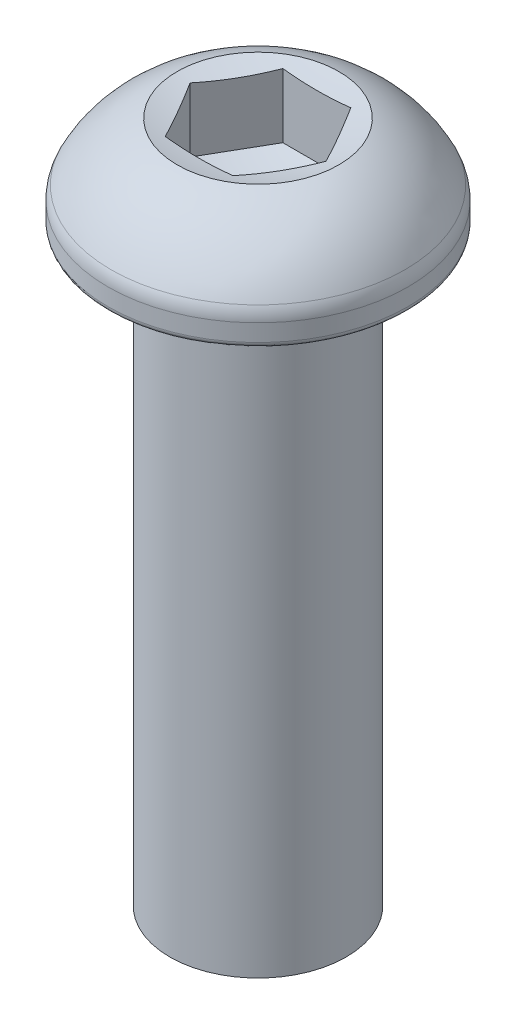
ISO-10303-21;
HEADER;
FILE_DESCRIPTION(('STEP AP214'),'2;1');
FILE_NAME('part.step','',(''),(''),'','','');
FILE_SCHEMA(('AUTOMOTIVE_DESIGN { 1 0 10303 214 1 1 1 1 }'));
ENDSEC;
DATA;
#1=APPLICATION_CONTEXT('core data for automotive mechanical design processes');
#2=APPLICATION_PROTOCOL_DEFINITION('international standard','automotive_design',2000,#1);
#3=PRODUCT_CONTEXT('',#1,'mechanical');
#4=PRODUCT('Part','Part','',(#3));
#5=PRODUCT_RELATED_PRODUCT_CATEGORY('part','',(#4));
#6=PRODUCT_DEFINITION_FORMATION('','',#4);
#7=PRODUCT_DEFINITION_CONTEXT('part definition',#1,'design');
#8=PRODUCT_DEFINITION('design','',#6,#7);
#9=PRODUCT_DEFINITION_SHAPE('','',#8);
#10=(LENGTH_UNIT() NAMED_UNIT(*) SI_UNIT(.MILLI.,.METRE.));
#11=(NAMED_UNIT(*) PLANE_ANGLE_UNIT() SI_UNIT($,.RADIAN.));
#12=(NAMED_UNIT(*) SI_UNIT($,.STERADIAN.) SOLID_ANGLE_UNIT());
#13=UNCERTAINTY_MEASURE_WITH_UNIT(LENGTH_MEASURE(1.E-05),#10,'distance_accuracy_value','');
#14=(GEOMETRIC_REPRESENTATION_CONTEXT(3) GLOBAL_UNCERTAINTY_ASSIGNED_CONTEXT((#13)) GLOBAL_UNIT_ASSIGNED_CONTEXT((#10,
#11,#12)) REPRESENTATION_CONTEXT('',''));
#15=CARTESIAN_POINT('',(0.,0.,0.));
#16=DIRECTION('',(0.,0.,1.));
#17=DIRECTION('',(1.,0.,0.));
#18=AXIS2_PLACEMENT_3D('',#15,#16,#17);
#19=CARTESIAN_POINT('',(0.,-0.573251742610998,0.));
#20=DIRECTION('',(0.,1.,0.));
#21=DIRECTION('',(0.,0.,1.));
#22=AXIS2_PLACEMENT_3D('',#19,#20,#21);
#23=DEGENERATE_TOROIDAL_SURFACE('',#22,1.42238134734289,4.,.T.);
#24=CARTESIAN_POINT('',(0.,1.23062475029976,0.));
#25=DIRECTION('',(0.,-1.,0.));
#26=DIRECTION('',(0.,0.,-1.));
#27=AXIS2_PLACEMENT_3D('',#24,#25,#26);
#28=CIRCLE('',#27,4.9925395508857);
#29=CARTESIAN_POINT('',(0.,1.23062475029976,-4.9925395508857));
#30=VERTEX_POINT('',#29);
#31=EDGE_CURVE('E136',#30,#30,#28,.F.);
#32=ORIENTED_EDGE('',*,*,#31,.T.);
#33=EDGE_LOOP('',(#32));
#34=FACE_BOUND('',#33,.T.);
#35=CARTESIAN_POINT('',(0.,3.2,0.));
#36=DIRECTION('',(0.,1.,0.));
#37=DIRECTION('',(0.,0.,1.));
#38=AXIS2_PLACEMENT_3D('',#35,#36,#37);
#39=CIRCLE('',#38,2.75);
#40=CARTESIAN_POINT('',(0.,3.2,2.75));
#41=VERTEX_POINT('',#40);
#42=EDGE_CURVE('E217',#41,#41,#39,.T.);
#43=ORIENTED_EDGE('',*,*,#42,.F.);
#44=EDGE_LOOP('',(#43));
#45=FACE_BOUND('',#44,.T.);
#46=ADVANCED_FACE('F39',(#34,#45),#23,.T.);
#47=CARTESIAN_POINT('',(0.,55.,0.));
#48=DIRECTION('',(0.,1.,0.));
#49=DIRECTION('',(0.,0.,1.));
#50=AXIS2_PLACEMENT_3D('',#47,#48,#49);
#51=CYLINDRICAL_SURFACE('',#50,5.1);
#52=CARTESIAN_POINT('',(0.,0.779655627072072,0.));
#53=DIRECTION('',(0.,-1.,0.));
#54=DIRECTION('',(0.,0.,-1.));
#55=AXIS2_PLACEMENT_3D('',#52,#53,#54);
#56=CIRCLE('',#55,5.1);
#57=CARTESIAN_POINT('',(0.,0.779655627072072,-5.1));
#58=VERTEX_POINT('',#57);
#59=EDGE_CURVE('E140',#58,#58,#56,.T.);
#60=ORIENTED_EDGE('',*,*,#59,.T.);
#61=EDGE_LOOP('',(#60));
#62=FACE_BOUND('',#61,.T.);
#63=CARTESIAN_POINT('',(0.,0.199999999999999,0.));
#64=DIRECTION('',(0.,1.,0.));
#65=DIRECTION('',(0.,0.,1.));
#66=AXIS2_PLACEMENT_3D('',#63,#64,#65);
#67=CIRCLE('',#66,5.1);
#68=CARTESIAN_POINT('',(0.,0.199999999999999,5.1));
#69=VERTEX_POINT('',#68);
#70=EDGE_CURVE('E128',#69,#69,#67,.T.);
#71=ORIENTED_EDGE('',*,*,#70,.T.);
#72=EDGE_LOOP('',(#71));
#73=FACE_BOUND('',#72,.T.);
#74=ADVANCED_FACE('F153',(#62,#73),#51,.T.);
#75=CARTESIAN_POINT('',(0.,0.,0.));
#76=DIRECTION('',(0.,1.,0.));
#77=DIRECTION('',(0.,0.,1.));
#78=AXIS2_PLACEMENT_3D('',#75,#76,#77);
#79=PLANE('',#78);
#80=CARTESIAN_POINT('',(0.,0.,0.));
#81=DIRECTION('',(0.,1.,0.));
#82=DIRECTION('',(0.,0.,1.));
#83=AXIS2_PLACEMENT_3D('',#80,#81,#82);
#84=CIRCLE('',#83,3.);
#85=CARTESIAN_POINT('',(0.,0.,3.));
#86=VERTEX_POINT('',#85);
#87=EDGE_CURVE('E48',#86,#86,#84,.F.);
#88=ORIENTED_EDGE('',*,*,#87,.F.);
#89=EDGE_LOOP('',(#88));
#90=FACE_BOUND('',#89,.T.);
#91=CARTESIAN_POINT('',(0.,0.,0.));
#92=DIRECTION('',(0.,1.,0.));
#93=DIRECTION('',(0.,0.,1.));
#94=AXIS2_PLACEMENT_3D('',#91,#92,#93);
#95=CIRCLE('',#94,4.9);
#96=CARTESIAN_POINT('',(0.,0.,4.9));
#97=VERTEX_POINT('',#96);
#98=EDGE_CURVE('E132',#97,#97,#95,.F.);
#99=ORIENTED_EDGE('',*,*,#98,.T.);
#100=EDGE_LOOP('',(#99));
#101=FACE_BOUND('',#100,.T.);
#102=ADVANCED_FACE('F149',(#90,#101),#79,.F.);
#103=CARTESIAN_POINT('',(0.,0.199999999999999,0.));
#104=DIRECTION('',(0.,1.,0.));
#105=DIRECTION('',(0.,0.,1.));
#106=AXIS2_PLACEMENT_3D('',#103,#104,#105);
#107=TOROIDAL_SURFACE('',#106,4.9,0.2);
#108=ORIENTED_EDGE('',*,*,#98,.F.);
#109=EDGE_LOOP('',(#108));
#110=FACE_BOUND('',#109,.T.);
#111=ORIENTED_EDGE('',*,*,#70,.F.);
#112=EDGE_LOOP('',(#111));
#113=FACE_BOUND('',#112,.T.);
#114=ADVANCED_FACE('F152',(#110,#113),#107,.T.);
#115=CARTESIAN_POINT('',(0.,0.779655627072072,0.));
#116=DIRECTION('',(0.,-1.,0.));
#117=DIRECTION('',(0.,0.,-1.));
#118=AXIS2_PLACEMENT_3D('',#115,#116,#117);
#119=TOROIDAL_SURFACE('',#118,4.1,1.);
#120=ORIENTED_EDGE('',*,*,#59,.F.);
#121=EDGE_LOOP('',(#120));
#122=FACE_BOUND('',#121,.T.);
#123=ORIENTED_EDGE('',*,*,#31,.F.);
#124=EDGE_LOOP('',(#123));
#125=FACE_BOUND('',#124,.T.);
#126=ADVANCED_FACE('F41',(#122,#125),#119,.T.);
#127=CARTESIAN_POINT('',(0.,-20.,0.));
#128=DIRECTION('',(0.,1.,0.));
#129=DIRECTION('',(0.,0.,1.));
#130=AXIS2_PLACEMENT_3D('',#127,#128,#129);
#131=CYLINDRICAL_SURFACE('',#130,3.);
#132=CARTESIAN_POINT('',(0.,-20.,0.));
#133=DIRECTION('',(0.,-1.,0.));
#134=DIRECTION('',(0.,0.,-1.));
#135=AXIS2_PLACEMENT_3D('',#132,#133,#134);
#136=CIRCLE('',#135,3.);
#137=CARTESIAN_POINT('',(0.,-20.,-3.));
#138=VERTEX_POINT('',#137);
#139=EDGE_CURVE('E124',#138,#138,#136,.T.);
#140=ORIENTED_EDGE('',*,*,#139,.F.);
#141=EDGE_LOOP('',(#140));
#142=FACE_BOUND('',#141,.T.);
#143=ORIENTED_EDGE('',*,*,#87,.T.);
#144=EDGE_LOOP('',(#143));
#145=FACE_BOUND('',#144,.T.);
#146=ADVANCED_FACE('F147',(#142,#145),#131,.T.);
#147=CARTESIAN_POINT('',(0.,-20.,0.));
#148=DIRECTION('',(0.,-1.,0.));
#149=DIRECTION('',(0.,0.,-1.));
#150=AXIS2_PLACEMENT_3D('',#147,#148,#149);
#151=PLANE('',#150);
#152=ORIENTED_EDGE('',*,*,#139,.T.);
#153=EDGE_LOOP('',(#152));
#154=FACE_BOUND('',#153,.T.);
#155=ADVANCED_FACE('F172',(#154),#151,.T.);
#156=CARTESIAN_POINT('',(0.,12.8144422615147,0.));
#157=DIRECTION('',(0.,1.,0.));
#158=DIRECTION('',(1.,0.,0.));
#159=AXIS2_PLACEMENT_3D('',#156,#157,#158);
#160=SPHERICAL_SURFACE('',#159,10.);
#161=ORIENTED_EDGE('',*,*,#42,.T.);
#162=EDGE_LOOP('',(#161));
#163=FACE_BOUND('',#162,.T.);
#164=CARTESIAN_POINT('',(-1.73205080756888,12.8144422615147,1.));
#165=DIRECTION('',(-0.866025403784438,0.,0.5));
#166=DIRECTION('',(0.5,0.,0.866025403784438));
#167=AXIS2_PLACEMENT_3D('',#164,#165,#166);
#168=CIRCLE('',#167,9.79795897113272);
#169=CARTESIAN_POINT('',(-2.3094010767585,3.08476258196376,0.));
#170=VERTEX_POINT('',#169);
#171=CARTESIAN_POINT('',(-1.15470053837925,3.08476258196376,2.));
#172=VERTEX_POINT('',#171);
#173=EDGE_CURVE('E108',#170,#172,#168,.T.);
#174=ORIENTED_EDGE('',*,*,#173,.F.);
#175=CARTESIAN_POINT('',(-1.73205080756888,12.8144422615147,-1.));
#176=DIRECTION('',(-0.866025403784438,0.,-0.5));
#177=DIRECTION('',(-0.5,0.,0.866025403784439));
#178=AXIS2_PLACEMENT_3D('',#175,#176,#177);
#179=CIRCLE('',#178,9.79795897113272);
#180=CARTESIAN_POINT('',(-1.15470053837925,3.08476258196376,-2.));
#181=VERTEX_POINT('',#180);
#182=EDGE_CURVE('E228',#181,#170,#179,.T.);
#183=ORIENTED_EDGE('',*,*,#182,.F.);
#184=CARTESIAN_POINT('',(0.,12.8144422615147,-2.));
#185=DIRECTION('',(0.,0.,-1.));
#186=DIRECTION('',(-1.,0.,0.));
#187=AXIS2_PLACEMENT_3D('',#184,#185,#186);
#188=CIRCLE('',#187,9.79795897113272);
#189=CARTESIAN_POINT('',(1.15470053837925,3.08476258196376,-2.));
#190=VERTEX_POINT('',#189);
#191=EDGE_CURVE('E222',#190,#181,#188,.T.);
#192=ORIENTED_EDGE('',*,*,#191,.F.);
#193=CARTESIAN_POINT('',(1.73205080756888,12.8144422615147,-1.));
#194=DIRECTION('',(0.866025403784438,0.,-0.5));
#195=DIRECTION('',(-0.5,0.,-0.866025403784438));
#196=AXIS2_PLACEMENT_3D('',#193,#194,#195);
#197=CIRCLE('',#196,9.79795897113272);
#198=CARTESIAN_POINT('',(2.3094010767585,3.08476258196376,0.));
#199=VERTEX_POINT('',#198);
#200=EDGE_CURVE('E55',#199,#190,#197,.T.);
#201=ORIENTED_EDGE('',*,*,#200,.F.);
#202=CARTESIAN_POINT('',(1.73205080756888,12.8144422615147,1.));
#203=DIRECTION('',(0.866025403784439,0.,0.5));
#204=DIRECTION('',(0.5,0.,-0.866025403784439));
#205=AXIS2_PLACEMENT_3D('',#202,#203,#204);
#206=CIRCLE('',#205,9.79795897113272);
#207=CARTESIAN_POINT('',(1.15470053837925,3.08476258196376,2.));
#208=VERTEX_POINT('',#207);
#209=EDGE_CURVE('E11',#208,#199,#206,.T.);
#210=ORIENTED_EDGE('',*,*,#209,.F.);
#211=CARTESIAN_POINT('',(0.,12.8144422615147,2.));
#212=DIRECTION('',(0.,0.,1.));
#213=DIRECTION('',(1.,0.,0.));
#214=AXIS2_PLACEMENT_3D('',#211,#212,#213);
#215=CIRCLE('',#214,9.79795897113272);
#216=EDGE_CURVE('E91',#172,#208,#215,.T.);
#217=ORIENTED_EDGE('',*,*,#216,.F.);
#218=EDGE_LOOP('',(#174,#183,#192,#201,#210,#217));
#219=FACE_BOUND('',#218,.T.);
#220=ADVANCED_FACE('F90',(#163,#219),#160,.F.);
#221=CARTESIAN_POINT('',(0.,0.5,0.));
#222=DIRECTION('',(0.,1.,0.));
#223=DIRECTION('',(0.,0.,1.));
#224=AXIS2_PLACEMENT_3D('',#221,#222,#223);
#225=PLANE('',#224);
#226=CARTESIAN_POINT('',(0.,0.5,0.));
#227=DIRECTION('',(0.,1.,0.));
#228=DIRECTION('',(0.,0.,1.));
#229=AXIS2_PLACEMENT_3D('',#226,#227,#228);
#230=CIRCLE('',#229,0.25);
#231=CARTESIAN_POINT('',(0.,0.5,0.25));
#232=VERTEX_POINT('',#231);
#233=EDGE_CURVE('E236',#232,#232,#230,.T.);
#234=ORIENTED_EDGE('',*,*,#233,.T.);
#235=EDGE_LOOP('',(#234));
#236=FACE_BOUND('',#235,.T.);
#237=ADVANCED_FACE('F204',(#236),#225,.T.);
#238=CARTESIAN_POINT('',(0.,6.0014159936926,0.));
#239=DIRECTION('',(0.,1.,0.));
#240=DIRECTION('',(0.,0.,1.));
#241=AXIS2_PLACEMENT_3D('',#238,#239,#240);
#242=DEGENERATE_TOROIDAL_SURFACE('',#241,0.25,5.5014159936926,.T.);
#243=CARTESIAN_POINT('',(0.,0.899999999999998,0.));
#244=DIRECTION('',(0.,1.,0.));
#245=DIRECTION('',(0.,0.,1.));
#246=AXIS2_PLACEMENT_3D('',#243,#244,#245);
#247=CIRCLE('',#246,2.3094010767585);
#248=CARTESIAN_POINT('',(1.15470053837925,0.9,2.));
#249=VERTEX_POINT('',#248);
#250=CARTESIAN_POINT('',(2.3094010767585,0.899999999999998,0.));
#251=VERTEX_POINT('',#250);
#252=EDGE_CURVE('E61',#249,#251,#247,.T.);
#253=ORIENTED_EDGE('',*,*,#252,.T.);
#254=CARTESIAN_POINT('',(1.15470053837925,0.899999999999998,-2.));
#255=VERTEX_POINT('',#254);
#256=EDGE_CURVE('E237',#251,#255,#247,.T.);
#257=ORIENTED_EDGE('',*,*,#256,.T.);
#258=CARTESIAN_POINT('',(-1.15470053837925,0.899999999999998,-2.));
#259=VERTEX_POINT('',#258);
#260=EDGE_CURVE('E277',#255,#259,#247,.T.);
#261=ORIENTED_EDGE('',*,*,#260,.T.);
#262=CARTESIAN_POINT('',(-2.3094010767585,0.899999999999998,0.));
#263=VERTEX_POINT('',#262);
#264=EDGE_CURVE('E282',#259,#263,#247,.T.);
#265=ORIENTED_EDGE('',*,*,#264,.T.);
#266=CARTESIAN_POINT('',(-1.15470053837925,0.899999999999998,2.));
#267=VERTEX_POINT('',#266);
#268=EDGE_CURVE('E287',#263,#267,#247,.T.);
#269=ORIENTED_EDGE('',*,*,#268,.T.);
#270=EDGE_CURVE('E107',#267,#249,#247,.T.);
#271=ORIENTED_EDGE('',*,*,#270,.T.);
#272=EDGE_LOOP('',(#253,#257,#261,#265,#269,#271));
#273=FACE_BOUND('',#272,.T.);
#274=ORIENTED_EDGE('',*,*,#233,.F.);
#275=EDGE_LOOP('',(#274));
#276=FACE_BOUND('',#275,.T.);
#277=ADVANCED_FACE('F202',(#273,#276),#242,.F.);
#278=CARTESIAN_POINT('',(0.,0.899999999999999,0.));
#279=DIRECTION('',(0.,-1.,0.));
#280=DIRECTION('',(0.,0.,-1.));
#281=AXIS2_PLACEMENT_3D('',#278,#279,#280);
#282=PLANE('',#281);
#283=DIRECTION('',(1.,0.,0.));
#284=VECTOR('',#283,1.);
#285=CARTESIAN_POINT('',(-1.15470053837925,0.9,2.));
#286=LINE('',#285,#284);
#287=EDGE_CURVE('E241',#267,#249,#286,.T.);
#288=ORIENTED_EDGE('',*,*,#287,.T.);
#289=ORIENTED_EDGE('',*,*,#270,.F.);
#290=EDGE_LOOP('',(#288,#289));
#291=FACE_BOUND('',#290,.T.);
#292=ADVANCED_FACE('F198',(#291),#282,.T.);
#293=DIRECTION('',(0.5,0.,0.866025403784438));
#294=VECTOR('',#293,1.);
#295=CARTESIAN_POINT('',(-2.3094010767585,0.9,0.));
#296=LINE('',#295,#294);
#297=EDGE_CURVE('E114',#263,#267,#296,.T.);
#298=ORIENTED_EDGE('',*,*,#297,.T.);
#299=ORIENTED_EDGE('',*,*,#268,.F.);
#300=EDGE_LOOP('',(#298,#299));
#301=FACE_BOUND('',#300,.T.);
#302=ADVANCED_FACE('F201',(#301),#282,.T.);
#303=DIRECTION('',(-0.5,0.,0.866025403784439));
#304=VECTOR('',#303,1.);
#305=CARTESIAN_POINT('',(-1.15470053837925,0.9,-2.));
#306=LINE('',#305,#304);
#307=EDGE_CURVE('E120',#259,#263,#306,.T.);
#308=ORIENTED_EDGE('',*,*,#307,.T.);
#309=ORIENTED_EDGE('',*,*,#264,.F.);
#310=EDGE_LOOP('',(#308,#309));
#311=FACE_BOUND('',#310,.T.);
#312=ADVANCED_FACE('F297',(#311),#282,.T.);
#313=DIRECTION('',(-1.,0.,0.));
#314=VECTOR('',#313,1.);
#315=CARTESIAN_POINT('',(1.15470053837925,0.9,-2.));
#316=LINE('',#315,#314);
#317=EDGE_CURVE('E250',#255,#259,#316,.T.);
#318=ORIENTED_EDGE('',*,*,#317,.T.);
#319=ORIENTED_EDGE('',*,*,#260,.F.);
#320=EDGE_LOOP('',(#318,#319));
#321=FACE_BOUND('',#320,.T.);
#322=ADVANCED_FACE('F278',(#321),#282,.T.);
#323=DIRECTION('',(-0.5,0.,-0.866025403784438));
#324=VECTOR('',#323,1.);
#325=CARTESIAN_POINT('',(2.3094010767585,0.9,0.));
#326=LINE('',#325,#324);
#327=EDGE_CURVE('E247',#251,#255,#326,.T.);
#328=ORIENTED_EDGE('',*,*,#327,.T.);
#329=ORIENTED_EDGE('',*,*,#256,.F.);
#330=EDGE_LOOP('',(#328,#329));
#331=FACE_BOUND('',#330,.T.);
#332=ADVANCED_FACE('F273',(#331),#282,.T.);
#333=DIRECTION('',(0.5,0.,-0.866025403784439));
#334=VECTOR('',#333,1.);
#335=CARTESIAN_POINT('',(1.15470053837925,0.9,2.));
#336=LINE('',#335,#334);
#337=EDGE_CURVE('E111',#249,#251,#336,.T.);
#338=ORIENTED_EDGE('',*,*,#337,.T.);
#339=ORIENTED_EDGE('',*,*,#252,.F.);
#340=EDGE_LOOP('',(#338,#339));
#341=FACE_BOUND('',#340,.T.);
#342=ADVANCED_FACE('F183',(#341),#282,.T.);
#343=CARTESIAN_POINT('',(1.15470053837925,0.9,2.));
#344=DIRECTION('',(0.866025403784439,0.,0.5));
#345=DIRECTION('',(0.5,0.,-0.866025403784439));
#346=AXIS2_PLACEMENT_3D('',#343,#344,#345);
#347=PLANE('',#346);
#348=DIRECTION('',(0.,1.,0.));
#349=VECTOR('',#348,1.);
#350=CARTESIAN_POINT('',(1.15470053837925,0.9,2.));
#351=LINE('',#350,#349);
#352=EDGE_CURVE('E102',#249,#208,#351,.T.);
#353=ORIENTED_EDGE('',*,*,#352,.T.);
#354=ORIENTED_EDGE('',*,*,#209,.T.);
#355=DIRECTION('',(0.,1.,0.));
#356=VECTOR('',#355,1.);
#357=CARTESIAN_POINT('',(2.3094010767585,0.9,0.));
#358=LINE('',#357,#356);
#359=EDGE_CURVE('E113',#251,#199,#358,.T.);
#360=ORIENTED_EDGE('',*,*,#359,.F.);
#361=ORIENTED_EDGE('',*,*,#337,.F.);
#362=EDGE_LOOP('',(#353,#354,#360,#361));
#363=FACE_BOUND('',#362,.T.);
#364=ADVANCED_FACE('F110',(#363),#347,.F.);
#365=CARTESIAN_POINT('',(2.3094010767585,0.9,0.));
#366=DIRECTION('',(0.866025403784438,0.,-0.5));
#367=DIRECTION('',(-0.5,0.,-0.866025403784438));
#368=AXIS2_PLACEMENT_3D('',#365,#366,#367);
#369=PLANE('',#368);
#370=ORIENTED_EDGE('',*,*,#359,.T.);
#371=ORIENTED_EDGE('',*,*,#200,.T.);
#372=DIRECTION('',(0.,1.,0.));
#373=VECTOR('',#372,1.);
#374=CARTESIAN_POINT('',(1.15470053837925,0.9,-2.));
#375=LINE('',#374,#373);
#376=EDGE_CURVE('E118',#255,#190,#375,.T.);
#377=ORIENTED_EDGE('',*,*,#376,.F.);
#378=ORIENTED_EDGE('',*,*,#327,.F.);
#379=EDGE_LOOP('',(#370,#371,#377,#378));
#380=FACE_BOUND('',#379,.T.);
#381=ADVANCED_FACE('F182',(#380),#369,.F.);
#382=CARTESIAN_POINT('',(1.15470053837925,0.9,-2.));
#383=DIRECTION('',(0.,0.,-1.));
#384=DIRECTION('',(-1.,0.,0.));
#385=AXIS2_PLACEMENT_3D('',#382,#383,#384);
#386=PLANE('',#385);
#387=ORIENTED_EDGE('',*,*,#376,.T.);
#388=ORIENTED_EDGE('',*,*,#191,.T.);
#389=DIRECTION('',(0.,1.,0.));
#390=VECTOR('',#389,1.);
#391=CARTESIAN_POINT('',(-1.15470053837925,0.9,-2.));
#392=LINE('',#391,#390);
#393=EDGE_CURVE('E261',#259,#181,#392,.T.);
#394=ORIENTED_EDGE('',*,*,#393,.F.);
#395=ORIENTED_EDGE('',*,*,#317,.F.);
#396=EDGE_LOOP('',(#387,#388,#394,#395));
#397=FACE_BOUND('',#396,.T.);
#398=ADVANCED_FACE('F186',(#397),#386,.F.);
#399=CARTESIAN_POINT('',(-1.15470053837925,0.9,-2.));
#400=DIRECTION('',(-0.866025403784438,0.,-0.5));
#401=DIRECTION('',(-0.5,0.,0.866025403784439));
#402=AXIS2_PLACEMENT_3D('',#399,#400,#401);
#403=PLANE('',#402);
#404=ORIENTED_EDGE('',*,*,#393,.T.);
#405=ORIENTED_EDGE('',*,*,#182,.T.);
#406=DIRECTION('',(0.,1.,0.));
#407=VECTOR('',#406,1.);
#408=CARTESIAN_POINT('',(-2.3094010767585,0.9,0.));
#409=LINE('',#408,#407);
#410=EDGE_CURVE('E257',#263,#170,#409,.T.);
#411=ORIENTED_EDGE('',*,*,#410,.F.);
#412=ORIENTED_EDGE('',*,*,#307,.F.);
#413=EDGE_LOOP('',(#404,#405,#411,#412));
#414=FACE_BOUND('',#413,.T.);
#415=ADVANCED_FACE('F190',(#414),#403,.F.);
#416=CARTESIAN_POINT('',(-2.3094010767585,0.9,0.));
#417=DIRECTION('',(-0.866025403784438,0.,0.5));
#418=DIRECTION('',(0.5,0.,0.866025403784438));
#419=AXIS2_PLACEMENT_3D('',#416,#417,#418);
#420=PLANE('',#419);
#421=ORIENTED_EDGE('',*,*,#410,.T.);
#422=ORIENTED_EDGE('',*,*,#173,.T.);
#423=DIRECTION('',(0.,1.,0.));
#424=VECTOR('',#423,1.);
#425=CARTESIAN_POINT('',(-1.15470053837925,0.9,2.));
#426=LINE('',#425,#424);
#427=EDGE_CURVE('E105',#267,#172,#426,.T.);
#428=ORIENTED_EDGE('',*,*,#427,.F.);
#429=ORIENTED_EDGE('',*,*,#297,.F.);
#430=EDGE_LOOP('',(#421,#422,#428,#429));
#431=FACE_BOUND('',#430,.T.);
#432=ADVANCED_FACE('F179',(#431),#420,.F.);
#433=CARTESIAN_POINT('',(-1.15470053837925,0.9,2.));
#434=DIRECTION('',(0.,0.,1.));
#435=DIRECTION('',(1.,0.,0.));
#436=AXIS2_PLACEMENT_3D('',#433,#434,#435);
#437=PLANE('',#436);
#438=ORIENTED_EDGE('',*,*,#427,.T.);
#439=ORIENTED_EDGE('',*,*,#216,.T.);
#440=ORIENTED_EDGE('',*,*,#352,.F.);
#441=ORIENTED_EDGE('',*,*,#287,.F.);
#442=EDGE_LOOP('',(#438,#439,#440,#441));
#443=FACE_BOUND('',#442,.T.);
#444=ADVANCED_FACE('F100',(#443),#437,.F.);
#445=CLOSED_SHELL('',(#46,#74,#102,#114,#126,#146,#155,#220,#237,#277,#292,#302,#312,#322,#332,
#342,#364,#381,#398,#415,#432,#444));
#446=MANIFOLD_SOLID_BREP('B2',#445);
#447=ADVANCED_BREP_SHAPE_REPRESENTATION('',(#18,#446),#14);
#448=SHAPE_DEFINITION_REPRESENTATION(#9,#447);
ENDSEC;
END-ISO-10303-21;
